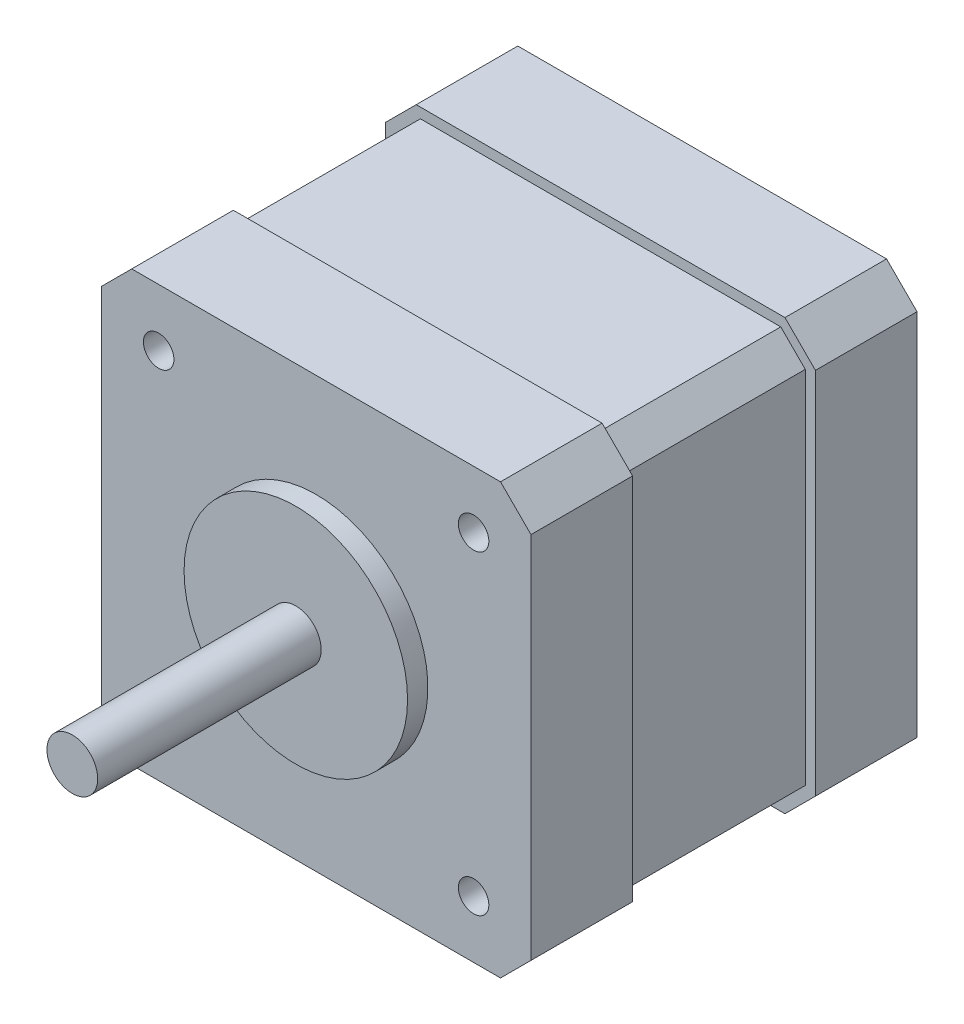
ISO-10303-21;
HEADER;
FILE_DESCRIPTION(('STEP AP214'),'2;1');
FILE_NAME('part.step','',(''),(''),'','','');
FILE_SCHEMA(('AUTOMOTIVE_DESIGN { 1 0 10303 214 1 1 1 1 }'));
ENDSEC;
DATA;
#1=APPLICATION_CONTEXT('core data for automotive mechanical design processes');
#2=APPLICATION_PROTOCOL_DEFINITION('international standard','automotive_design',2000,#1);
#3=PRODUCT_CONTEXT('',#1,'mechanical');
#4=PRODUCT('Part','Part','',(#3));
#5=PRODUCT_RELATED_PRODUCT_CATEGORY('part','',(#4));
#6=PRODUCT_DEFINITION_FORMATION('','',#4);
#7=PRODUCT_DEFINITION_CONTEXT('part definition',#1,'design');
#8=PRODUCT_DEFINITION('design','',#6,#7);
#9=PRODUCT_DEFINITION_SHAPE('','',#8);
#10=(LENGTH_UNIT() NAMED_UNIT(*) SI_UNIT(.MILLI.,.METRE.));
#11=(NAMED_UNIT(*) PLANE_ANGLE_UNIT() SI_UNIT($,.RADIAN.));
#12=(NAMED_UNIT(*) SI_UNIT($,.STERADIAN.) SOLID_ANGLE_UNIT());
#13=UNCERTAINTY_MEASURE_WITH_UNIT(LENGTH_MEASURE(1.E-05),#10,'distance_accuracy_value','');
#14=(GEOMETRIC_REPRESENTATION_CONTEXT(3) GLOBAL_UNCERTAINTY_ASSIGNED_CONTEXT((#13)) GLOBAL_UNIT_ASSIGNED_CONTEXT((#10,
#11,#12)) REPRESENTATION_CONTEXT('',''));
#15=CARTESIAN_POINT('',(0.,0.,0.));
#16=DIRECTION('',(0.,0.,1.));
#17=DIRECTION('',(1.,0.,0.));
#18=AXIS2_PLACEMENT_3D('',#15,#16,#17);
#19=CARTESIAN_POINT('',(0.,0.,0.));
#20=DIRECTION('',(0.,0.,-1.));
#21=DIRECTION('',(-1.,0.,0.));
#22=AXIS2_PLACEMENT_3D('',#19,#20,#21);
#23=PLANE('',#22);
#24=DIRECTION('',(-0.707106781186548,-0.707106781186548,0.));
#25=VECTOR('',#24,1.);
#26=CARTESIAN_POINT('',(-32.7677538051841,19.7638051044083,0.));
#27=LINE('',#26,#25);
#28=CARTESIAN_POINT('',(-29.7677538051841,22.7638051044083,0.));
#29=VERTEX_POINT('',#28);
#30=CARTESIAN_POINT('',(-32.7677538051841,19.7638051044083,0.));
#31=VERTEX_POINT('',#30);
#32=EDGE_CURVE('E147',#29,#31,#27,.T.);
#33=ORIENTED_EDGE('',*,*,#32,.F.);
#34=DIRECTION('',(-1.,0.,0.));
#35=VECTOR('',#34,1.);
#36=CARTESIAN_POINT('',(-29.7677538051841,22.7638051044083,0.));
#37=LINE('',#36,#35);
#38=CARTESIAN_POINT('',(6.53224619481587,22.7638051044083,0.));
#39=VERTEX_POINT('',#38);
#40=EDGE_CURVE('E93',#39,#29,#37,.T.);
#41=ORIENTED_EDGE('',*,*,#40,.F.);
#42=DIRECTION('',(-0.707106781186548,0.707106781186547,0.));
#43=VECTOR('',#42,1.);
#44=CARTESIAN_POINT('',(6.53224619481587,22.7638051044083,0.));
#45=LINE('',#44,#43);
#46=CARTESIAN_POINT('',(9.53224619481587,19.7638051044083,0.));
#47=VERTEX_POINT('',#46);
#48=EDGE_CURVE('E160',#47,#39,#45,.T.);
#49=ORIENTED_EDGE('',*,*,#48,.F.);
#50=DIRECTION('',(0.,1.,0.));
#51=VECTOR('',#50,1.);
#52=CARTESIAN_POINT('',(9.53224619481587,19.7638051044083,0.));
#53=LINE('',#52,#51);
#54=CARTESIAN_POINT('',(9.53224619481587,-16.5361948955916,0.));
#55=VERTEX_POINT('',#54);
#56=EDGE_CURVE('E135',#55,#47,#53,.T.);
#57=ORIENTED_EDGE('',*,*,#56,.F.);
#58=DIRECTION('',(0.707106781186548,0.707106781186547,0.));
#59=VECTOR('',#58,1.);
#60=CARTESIAN_POINT('',(9.53224619481587,-16.5361948955916,0.));
#61=LINE('',#60,#59);
#62=CARTESIAN_POINT('',(6.53224619481587,-19.5361948955916,0.));
#63=VERTEX_POINT('',#62);
#64=EDGE_CURVE('E157',#63,#55,#61,.T.);
#65=ORIENTED_EDGE('',*,*,#64,.F.);
#66=DIRECTION('',(1.,0.,0.));
#67=VECTOR('',#66,1.);
#68=CARTESIAN_POINT('',(6.53224619481587,-19.5361948955916,0.));
#69=LINE('',#68,#67);
#70=CARTESIAN_POINT('',(-29.7677538051841,-19.5361948955916,0.));
#71=VERTEX_POINT('',#70);
#72=EDGE_CURVE('E155',#71,#63,#69,.T.);
#73=ORIENTED_EDGE('',*,*,#72,.F.);
#74=DIRECTION('',(0.707106781186548,-0.707106781186548,0.));
#75=VECTOR('',#74,1.);
#76=CARTESIAN_POINT('',(-29.7677538051841,-19.5361948955916,0.));
#77=LINE('',#76,#75);
#78=CARTESIAN_POINT('',(-32.7677538051841,-16.5361948955916,0.));
#79=VERTEX_POINT('',#78);
#80=EDGE_CURVE('E153',#79,#71,#77,.T.);
#81=ORIENTED_EDGE('',*,*,#80,.F.);
#82=DIRECTION('',(0.,-1.,0.));
#83=VECTOR('',#82,1.);
#84=CARTESIAN_POINT('',(-32.7677538051841,-16.5361948955916,0.));
#85=LINE('',#84,#83);
#86=EDGE_CURVE('E150',#31,#79,#85,.T.);
#87=ORIENTED_EDGE('',*,*,#86,.F.);
#88=EDGE_LOOP('',(#33,#41,#49,#57,#65,#73,#81,#87));
#89=FACE_BOUND('',#88,.T.);
#90=DIRECTION('',(0.707106781186548,-0.707106781186547,0.));
#91=VECTOR('',#90,1.);
#92=CARTESIAN_POINT('',(8.53224619481587,19.3495915420353,0.));
#93=LINE('',#92,#91);
#94=CARTESIAN_POINT('',(6.11803263244278,21.7638051044083,0.));
#95=VERTEX_POINT('',#94);
#96=CARTESIAN_POINT('',(8.53224619481587,19.3495915420353,0.));
#97=VERTEX_POINT('',#96);
#98=EDGE_CURVE('E303',#95,#97,#93,.T.);
#99=ORIENTED_EDGE('',*,*,#98,.F.);
#100=DIRECTION('',(1.,0.,0.));
#101=VECTOR('',#100,1.);
#102=CARTESIAN_POINT('',(-11.6177538051841,21.7638051044083,0.));
#103=LINE('',#102,#101);
#104=CARTESIAN_POINT('',(-29.353540242811,21.7638051044083,0.));
#105=VERTEX_POINT('',#104);
#106=EDGE_CURVE('E254',#105,#95,#103,.T.);
#107=ORIENTED_EDGE('',*,*,#106,.F.);
#108=DIRECTION('',(0.707106781186547,0.707106781186547,0.));
#109=VECTOR('',#108,1.);
#110=CARTESIAN_POINT('',(-29.353540242811,21.7638051044083,0.));
#111=LINE('',#110,#109);
#112=CARTESIAN_POINT('',(-31.7677538051841,19.3495915420352,0.));
#113=VERTEX_POINT('',#112);
#114=EDGE_CURVE('E279',#113,#105,#111,.T.);
#115=ORIENTED_EDGE('',*,*,#114,.F.);
#116=DIRECTION('',(0.,1.,0.));
#117=VECTOR('',#116,1.);
#118=CARTESIAN_POINT('',(-31.7677538051841,-16.1219813332185,0.));
#119=LINE('',#118,#117);
#120=CARTESIAN_POINT('',(-31.7677538051841,-16.1219813332185,0.));
#121=VERTEX_POINT('',#120);
#122=EDGE_CURVE('E318',#121,#113,#119,.T.);
#123=ORIENTED_EDGE('',*,*,#122,.F.);
#124=DIRECTION('',(-0.707106781186549,0.707106781186547,0.));
#125=VECTOR('',#124,1.);
#126=CARTESIAN_POINT('',(-29.353540242811,-18.5361948955917,0.));
#127=LINE('',#126,#125);
#128=CARTESIAN_POINT('',(-29.353540242811,-18.5361948955917,0.));
#129=VERTEX_POINT('',#128);
#130=EDGE_CURVE('E315',#129,#121,#127,.T.);
#131=ORIENTED_EDGE('',*,*,#130,.F.);
#132=DIRECTION('',(-1.,0.,0.));
#133=VECTOR('',#132,1.);
#134=CARTESIAN_POINT('',(6.11803263244278,-18.5361948955916,0.));
#135=LINE('',#134,#133);
#136=CARTESIAN_POINT('',(6.11803263244278,-18.5361948955916,0.));
#137=VERTEX_POINT('',#136);
#138=EDGE_CURVE('E312',#137,#129,#135,.T.);
#139=ORIENTED_EDGE('',*,*,#138,.F.);
#140=DIRECTION('',(-0.707106781186547,-0.707106781186547,0.));
#141=VECTOR('',#140,1.);
#142=CARTESIAN_POINT('',(8.53224619481587,-16.1219813332186,0.));
#143=LINE('',#142,#141);
#144=CARTESIAN_POINT('',(8.53224619481587,-16.1219813332186,0.));
#145=VERTEX_POINT('',#144);
#146=EDGE_CURVE('E309',#145,#137,#143,.T.);
#147=ORIENTED_EDGE('',*,*,#146,.F.);
#148=DIRECTION('',(0.,-1.,0.));
#149=VECTOR('',#148,1.);
#150=CARTESIAN_POINT('',(8.53224619481587,19.3495915420353,0.));
#151=LINE('',#150,#149);
#152=EDGE_CURVE('E306',#97,#145,#151,.T.);
#153=ORIENTED_EDGE('',*,*,#152,.F.);
#154=EDGE_LOOP('',(#99,#107,#115,#123,#131,#139,#147,#153));
#155=FACE_BOUND('',#154,.T.);
#156=ADVANCED_FACE('F34',(#89,#155),#23,.T.);
#157=CARTESIAN_POINT('',(-11.6177538051841,1.61380510440835,12.));
#158=DIRECTION('',(0.,0.,1.));
#159=DIRECTION('',(1.,0.,0.));
#160=AXIS2_PLACEMENT_3D('',#157,#158,#159);
#161=PLANE('',#160);
#162=CARTESIAN_POINT('',(-11.6177538051841,1.61380510440835,12.));
#163=DIRECTION('',(0.,0.,1.));
#164=DIRECTION('',(1.,0.,0.));
#165=AXIS2_PLACEMENT_3D('',#162,#163,#164);
#166=CIRCLE('',#165,11.);
#167=CARTESIAN_POINT('',(-0.617753805184125,1.61380510440835,12.));
#168=VERTEX_POINT('',#167);
#169=EDGE_CURVE('E151',#168,#168,#166,.T.);
#170=ORIENTED_EDGE('',*,*,#169,.T.);
#171=EDGE_LOOP('',(#170));
#172=FACE_BOUND('',#171,.T.);
#173=CARTESIAN_POINT('',(-11.6177538051841,1.61380510440835,12.));
#174=DIRECTION('',(0.,0.,1.));
#175=DIRECTION('',(1.,0.,0.));
#176=AXIS2_PLACEMENT_3D('',#173,#174,#175);
#177=CIRCLE('',#176,2.5);
#178=CARTESIAN_POINT('',(-9.11775380518413,1.61380510440835,12.));
#179=VERTEX_POINT('',#178);
#180=EDGE_CURVE('E342',#179,#179,#177,.T.);
#181=ORIENTED_EDGE('',*,*,#180,.F.);
#182=EDGE_LOOP('',(#181));
#183=FACE_BOUND('',#182,.T.);
#184=ADVANCED_FACE('F384',(#172,#183),#161,.T.);
#185=CARTESIAN_POINT('',(0.,0.,10.));
#186=DIRECTION('',(0.,0.,-1.));
#187=DIRECTION('',(-1.,0.,0.));
#188=AXIS2_PLACEMENT_3D('',#185,#186,#187);
#189=PLANE('',#188);
#190=CARTESIAN_POINT('',(-27.1177538051841,-13.8861948955917,10.));
#191=DIRECTION('',(0.,0.,1.));
#192=DIRECTION('',(1.,0.,0.));
#193=AXIS2_PLACEMENT_3D('',#190,#191,#192);
#194=CIRCLE('',#193,1.5);
#195=CARTESIAN_POINT('',(-25.6177538051841,-13.8861948955917,10.));
#196=VERTEX_POINT('',#195);
#197=EDGE_CURVE('E197',#196,#196,#194,.T.);
#198=ORIENTED_EDGE('',*,*,#197,.F.);
#199=EDGE_LOOP('',(#198));
#200=FACE_BOUND('',#199,.T.);
#201=CARTESIAN_POINT('',(3.88224619481587,-13.8861948955917,10.));
#202=DIRECTION('',(0.,0.,1.));
#203=DIRECTION('',(1.,0.,0.));
#204=AXIS2_PLACEMENT_3D('',#201,#202,#203);
#205=CIRCLE('',#204,1.5);
#206=CARTESIAN_POINT('',(5.38224619481587,-13.8861948955917,10.));
#207=VERTEX_POINT('',#206);
#208=EDGE_CURVE('E187',#207,#207,#205,.T.);
#209=ORIENTED_EDGE('',*,*,#208,.F.);
#210=EDGE_LOOP('',(#209));
#211=FACE_BOUND('',#210,.T.);
#212=CARTESIAN_POINT('',(3.88224619481587,17.1138051044083,10.));
#213=DIRECTION('',(0.,0.,1.));
#214=DIRECTION('',(1.,0.,0.));
#215=AXIS2_PLACEMENT_3D('',#212,#213,#214);
#216=CIRCLE('',#215,1.5);
#217=CARTESIAN_POINT('',(5.38224619481587,17.1138051044083,10.));
#218=VERTEX_POINT('',#217);
#219=EDGE_CURVE('E184',#218,#218,#216,.T.);
#220=ORIENTED_EDGE('',*,*,#219,.F.);
#221=EDGE_LOOP('',(#220));
#222=FACE_BOUND('',#221,.T.);
#223=CARTESIAN_POINT('',(-27.1177538051841,17.1138051044083,10.));
#224=DIRECTION('',(0.,0.,1.));
#225=DIRECTION('',(1.,0.,0.));
#226=AXIS2_PLACEMENT_3D('',#223,#224,#225);
#227=CIRCLE('',#226,1.5);
#228=CARTESIAN_POINT('',(-25.6177538051841,17.1138051044083,10.));
#229=VERTEX_POINT('',#228);
#230=EDGE_CURVE('E181',#229,#229,#227,.T.);
#231=ORIENTED_EDGE('',*,*,#230,.F.);
#232=EDGE_LOOP('',(#231));
#233=FACE_BOUND('',#232,.T.);
#234=DIRECTION('',(-0.707106781186548,-0.707106781186548,0.));
#235=VECTOR('',#234,1.);
#236=CARTESIAN_POINT('',(-32.7677538051841,19.7638051044083,10.));
#237=LINE('',#236,#235);
#238=CARTESIAN_POINT('',(-29.7677538051841,22.7638051044083,10.));
#239=VERTEX_POINT('',#238);
#240=CARTESIAN_POINT('',(-32.7677538051841,19.7638051044083,10.));
#241=VERTEX_POINT('',#240);
#242=EDGE_CURVE('E163',#239,#241,#237,.T.);
#243=ORIENTED_EDGE('',*,*,#242,.T.);
#244=DIRECTION('',(0.,-1.,0.));
#245=VECTOR('',#244,1.);
#246=CARTESIAN_POINT('',(-32.7677538051841,-16.5361948955916,10.));
#247=LINE('',#246,#245);
#248=CARTESIAN_POINT('',(-32.7677538051841,-16.5361948955916,10.));
#249=VERTEX_POINT('',#248);
#250=EDGE_CURVE('E102',#241,#249,#247,.T.);
#251=ORIENTED_EDGE('',*,*,#250,.T.);
#252=DIRECTION('',(0.707106781186548,-0.707106781186548,0.));
#253=VECTOR('',#252,1.);
#254=CARTESIAN_POINT('',(-29.7677538051841,-19.5361948955916,10.));
#255=LINE('',#254,#253);
#256=CARTESIAN_POINT('',(-29.7677538051841,-19.5361948955916,10.));
#257=VERTEX_POINT('',#256);
#258=EDGE_CURVE('E352',#249,#257,#255,.T.);
#259=ORIENTED_EDGE('',*,*,#258,.T.);
#260=DIRECTION('',(1.,0.,0.));
#261=VECTOR('',#260,1.);
#262=CARTESIAN_POINT('',(6.53224619481587,-19.5361948955916,10.));
#263=LINE('',#262,#261);
#264=CARTESIAN_POINT('',(6.53224619481587,-19.5361948955916,10.));
#265=VERTEX_POINT('',#264);
#266=EDGE_CURVE('E354',#257,#265,#263,.T.);
#267=ORIENTED_EDGE('',*,*,#266,.T.);
#268=DIRECTION('',(0.707106781186548,0.707106781186547,0.));
#269=VECTOR('',#268,1.);
#270=CARTESIAN_POINT('',(9.53224619481587,-16.5361948955916,10.));
#271=LINE('',#270,#269);
#272=CARTESIAN_POINT('',(9.53224619481587,-16.5361948955916,10.));
#273=VERTEX_POINT('',#272);
#274=EDGE_CURVE('E126',#265,#273,#271,.T.);
#275=ORIENTED_EDGE('',*,*,#274,.T.);
#276=DIRECTION('',(0.,1.,0.));
#277=VECTOR('',#276,1.);
#278=CARTESIAN_POINT('',(9.53224619481587,19.7638051044083,10.));
#279=LINE('',#278,#277);
#280=CARTESIAN_POINT('',(9.53224619481587,19.7638051044083,10.));
#281=VERTEX_POINT('',#280);
#282=EDGE_CURVE('E118',#273,#281,#279,.T.);
#283=ORIENTED_EDGE('',*,*,#282,.T.);
#284=DIRECTION('',(-0.707106781186548,0.707106781186547,0.));
#285=VECTOR('',#284,1.);
#286=CARTESIAN_POINT('',(6.53224619481587,22.7638051044083,10.));
#287=LINE('',#286,#285);
#288=CARTESIAN_POINT('',(6.53224619481587,22.7638051044083,10.));
#289=VERTEX_POINT('',#288);
#290=EDGE_CURVE('E123',#281,#289,#287,.T.);
#291=ORIENTED_EDGE('',*,*,#290,.T.);
#292=DIRECTION('',(-1.,0.,0.));
#293=VECTOR('',#292,1.);
#294=CARTESIAN_POINT('',(-29.7677538051841,22.7638051044083,10.));
#295=LINE('',#294,#293);
#296=EDGE_CURVE('E60',#289,#239,#295,.T.);
#297=ORIENTED_EDGE('',*,*,#296,.T.);
#298=EDGE_LOOP('',(#243,#251,#259,#267,#275,#283,#291,#297));
#299=FACE_BOUND('',#298,.T.);
#300=CARTESIAN_POINT('',(-11.6177538051841,1.61380510440835,10.));
#301=DIRECTION('',(0.,0.,-1.));
#302=DIRECTION('',(-1.,0.,0.));
#303=AXIS2_PLACEMENT_3D('',#300,#301,#302);
#304=CIRCLE('',#303,11.);
#305=CARTESIAN_POINT('',(-22.6177538051841,1.61380510440835,10.));
#306=VERTEX_POINT('',#305);
#307=EDGE_CURVE('E11',#306,#306,#304,.F.);
#308=ORIENTED_EDGE('',*,*,#307,.F.);
#309=EDGE_LOOP('',(#308));
#310=FACE_BOUND('',#309,.T.);
#311=ADVANCED_FACE('F120',(#200,#211,#222,#233,#299,#310),#189,.F.);
#312=CARTESIAN_POINT('',(-32.7677538051841,19.7638051044083,10.));
#313=DIRECTION('',(0.707106781186548,-0.707106781186548,0.));
#314=DIRECTION('',(0.707106781186548,0.707106781186548,0.));
#315=AXIS2_PLACEMENT_3D('',#312,#313,#314);
#316=PLANE('',#315);
#317=ORIENTED_EDGE('',*,*,#32,.T.);
#318=DIRECTION('',(0.,0.,-1.));
#319=VECTOR('',#318,1.);
#320=CARTESIAN_POINT('',(-32.7677538051841,19.7638051044083,10.));
#321=LINE('',#320,#319);
#322=EDGE_CURVE('E43',#241,#31,#321,.T.);
#323=ORIENTED_EDGE('',*,*,#322,.F.);
#324=ORIENTED_EDGE('',*,*,#242,.F.);
#325=DIRECTION('',(0.,0.,-1.));
#326=VECTOR('',#325,1.);
#327=CARTESIAN_POINT('',(-29.7677538051841,22.7638051044083,10.));
#328=LINE('',#327,#326);
#329=EDGE_CURVE('E143',#239,#29,#328,.T.);
#330=ORIENTED_EDGE('',*,*,#329,.T.);
#331=EDGE_LOOP('',(#317,#323,#324,#330));
#332=FACE_BOUND('',#331,.T.);
#333=ADVANCED_FACE('F36',(#332),#316,.F.);
#334=CARTESIAN_POINT('',(-32.7677538051841,-16.5361948955916,10.));
#335=DIRECTION('',(1.,0.,0.));
#336=DIRECTION('',(0.,0.,-1.));
#337=AXIS2_PLACEMENT_3D('',#334,#335,#336);
#338=PLANE('',#337);
#339=ORIENTED_EDGE('',*,*,#86,.T.);
#340=DIRECTION('',(0.,0.,-1.));
#341=VECTOR('',#340,1.);
#342=CARTESIAN_POINT('',(-32.7677538051841,-16.5361948955916,10.));
#343=LINE('',#342,#341);
#344=EDGE_CURVE('E173',#249,#79,#343,.T.);
#345=ORIENTED_EDGE('',*,*,#344,.F.);
#346=ORIENTED_EDGE('',*,*,#250,.F.);
#347=ORIENTED_EDGE('',*,*,#322,.T.);
#348=EDGE_LOOP('',(#339,#345,#346,#347));
#349=FACE_BOUND('',#348,.T.);
#350=ADVANCED_FACE('F372',(#349),#338,.F.);
#351=CARTESIAN_POINT('',(-29.7677538051841,-19.5361948955916,10.));
#352=DIRECTION('',(0.707106781186548,0.707106781186548,0.));
#353=DIRECTION('',(-0.707106781186548,0.707106781186548,0.));
#354=AXIS2_PLACEMENT_3D('',#351,#352,#353);
#355=PLANE('',#354);
#356=ORIENTED_EDGE('',*,*,#80,.T.);
#357=DIRECTION('',(0.,0.,-1.));
#358=VECTOR('',#357,1.);
#359=CARTESIAN_POINT('',(-29.7677538051841,-19.5361948955916,10.));
#360=LINE('',#359,#358);
#361=EDGE_CURVE('E170',#257,#71,#360,.T.);
#362=ORIENTED_EDGE('',*,*,#361,.F.);
#363=ORIENTED_EDGE('',*,*,#258,.F.);
#364=ORIENTED_EDGE('',*,*,#344,.T.);
#365=EDGE_LOOP('',(#356,#362,#363,#364));
#366=FACE_BOUND('',#365,.T.);
#367=ADVANCED_FACE('F375',(#366),#355,.F.);
#368=CARTESIAN_POINT('',(6.53224619481587,-19.5361948955916,10.));
#369=DIRECTION('',(0.,1.,0.));
#370=DIRECTION('',(0.,0.,1.));
#371=AXIS2_PLACEMENT_3D('',#368,#369,#370);
#372=PLANE('',#371);
#373=ORIENTED_EDGE('',*,*,#72,.T.);
#374=DIRECTION('',(0.,0.,-1.));
#375=VECTOR('',#374,1.);
#376=CARTESIAN_POINT('',(6.53224619481587,-19.5361948955916,10.));
#377=LINE('',#376,#375);
#378=EDGE_CURVE('E167',#265,#63,#377,.T.);
#379=ORIENTED_EDGE('',*,*,#378,.F.);
#380=ORIENTED_EDGE('',*,*,#266,.F.);
#381=ORIENTED_EDGE('',*,*,#361,.T.);
#382=EDGE_LOOP('',(#373,#379,#380,#381));
#383=FACE_BOUND('',#382,.T.);
#384=ADVANCED_FACE('F360',(#383),#372,.F.);
#385=CARTESIAN_POINT('',(9.53224619481587,-16.5361948955916,10.));
#386=DIRECTION('',(-0.707106781186547,0.707106781186548,0.));
#387=DIRECTION('',(-0.707106781186548,-0.707106781186547,0.));
#388=AXIS2_PLACEMENT_3D('',#385,#386,#387);
#389=PLANE('',#388);
#390=ORIENTED_EDGE('',*,*,#64,.T.);
#391=DIRECTION('',(0.,0.,-1.));
#392=VECTOR('',#391,1.);
#393=CARTESIAN_POINT('',(9.53224619481587,-16.5361948955916,10.));
#394=LINE('',#393,#392);
#395=EDGE_CURVE('E138',#273,#55,#394,.T.);
#396=ORIENTED_EDGE('',*,*,#395,.F.);
#397=ORIENTED_EDGE('',*,*,#274,.F.);
#398=ORIENTED_EDGE('',*,*,#378,.T.);
#399=EDGE_LOOP('',(#390,#396,#397,#398));
#400=FACE_BOUND('',#399,.T.);
#401=ADVANCED_FACE('F364',(#400),#389,.F.);
#402=CARTESIAN_POINT('',(9.53224619481587,19.7638051044083,10.));
#403=DIRECTION('',(-1.,0.,0.));
#404=DIRECTION('',(0.,0.,1.));
#405=AXIS2_PLACEMENT_3D('',#402,#403,#404);
#406=PLANE('',#405);
#407=ORIENTED_EDGE('',*,*,#56,.T.);
#408=DIRECTION('',(0.,0.,-1.));
#409=VECTOR('',#408,1.);
#410=CARTESIAN_POINT('',(9.53224619481587,19.7638051044083,10.));
#411=LINE('',#410,#409);
#412=EDGE_CURVE('E132',#281,#47,#411,.T.);
#413=ORIENTED_EDGE('',*,*,#412,.F.);
#414=ORIENTED_EDGE('',*,*,#282,.F.);
#415=ORIENTED_EDGE('',*,*,#395,.T.);
#416=EDGE_LOOP('',(#407,#413,#414,#415));
#417=FACE_BOUND('',#416,.T.);
#418=ADVANCED_FACE('F133',(#417),#406,.F.);
#419=CARTESIAN_POINT('',(6.53224619481587,22.7638051044083,10.));
#420=DIRECTION('',(-0.707106781186547,-0.707106781186548,0.));
#421=DIRECTION('',(0.707106781186548,-0.707106781186547,0.));
#422=AXIS2_PLACEMENT_3D('',#419,#420,#421);
#423=PLANE('',#422);
#424=ORIENTED_EDGE('',*,*,#48,.T.);
#425=DIRECTION('',(0.,0.,-1.));
#426=VECTOR('',#425,1.);
#427=CARTESIAN_POINT('',(6.53224619481587,22.7638051044083,10.));
#428=LINE('',#427,#426);
#429=EDGE_CURVE('E139',#289,#39,#428,.T.);
#430=ORIENTED_EDGE('',*,*,#429,.F.);
#431=ORIENTED_EDGE('',*,*,#290,.F.);
#432=ORIENTED_EDGE('',*,*,#412,.T.);
#433=EDGE_LOOP('',(#424,#430,#431,#432));
#434=FACE_BOUND('',#433,.T.);
#435=ADVANCED_FACE('F141',(#434),#423,.F.);
#436=CARTESIAN_POINT('',(-29.7677538051841,22.7638051044083,10.));
#437=DIRECTION('',(0.,-1.,0.));
#438=DIRECTION('',(0.,0.,-1.));
#439=AXIS2_PLACEMENT_3D('',#436,#437,#438);
#440=PLANE('',#439);
#441=ORIENTED_EDGE('',*,*,#40,.T.);
#442=ORIENTED_EDGE('',*,*,#329,.F.);
#443=ORIENTED_EDGE('',*,*,#296,.F.);
#444=ORIENTED_EDGE('',*,*,#429,.T.);
#445=EDGE_LOOP('',(#441,#442,#443,#444));
#446=FACE_BOUND('',#445,.T.);
#447=ADVANCED_FACE('F368',(#446),#440,.F.);
#448=CARTESIAN_POINT('',(-11.6177538051841,1.61380510440835,12.));
#449=DIRECTION('',(0.,0.,-1.));
#450=DIRECTION('',(-1.,0.,0.));
#451=AXIS2_PLACEMENT_3D('',#448,#449,#450);
#452=CYLINDRICAL_SURFACE('',#451,11.);
#453=ORIENTED_EDGE('',*,*,#169,.F.);
#454=EDGE_LOOP('',(#453));
#455=FACE_BOUND('',#454,.T.);
#456=ORIENTED_EDGE('',*,*,#307,.T.);
#457=EDGE_LOOP('',(#456));
#458=FACE_BOUND('',#457,.T.);
#459=ADVANCED_FACE('F396',(#455,#458),#452,.T.);
#460=CARTESIAN_POINT('',(-11.6177538051841,1.61380510440835,34.));
#461=DIRECTION('',(0.,0.,-1.));
#462=DIRECTION('',(-1.,0.,0.));
#463=AXIS2_PLACEMENT_3D('',#460,#461,#462);
#464=CYLINDRICAL_SURFACE('',#463,2.5);
#465=CARTESIAN_POINT('',(-11.6177538051841,1.61380510440835,34.));
#466=DIRECTION('',(0.,0.,1.));
#467=DIRECTION('',(1.,0.,0.));
#468=AXIS2_PLACEMENT_3D('',#465,#466,#467);
#469=CIRCLE('',#468,2.5);
#470=CARTESIAN_POINT('',(-9.11775380518413,1.61380510440835,34.));
#471=VERTEX_POINT('',#470);
#472=EDGE_CURVE('E343',#471,#471,#469,.T.);
#473=ORIENTED_EDGE('',*,*,#472,.F.);
#474=EDGE_LOOP('',(#473));
#475=FACE_BOUND('',#474,.T.);
#476=ORIENTED_EDGE('',*,*,#180,.T.);
#477=EDGE_LOOP('',(#476));
#478=FACE_BOUND('',#477,.T.);
#479=ADVANCED_FACE('F425',(#475,#478),#464,.T.);
#480=CARTESIAN_POINT('',(-11.6177538051841,1.61380510440835,34.));
#481=DIRECTION('',(0.,0.,1.));
#482=DIRECTION('',(1.,0.,0.));
#483=AXIS2_PLACEMENT_3D('',#480,#481,#482);
#484=PLANE('',#483);
#485=ORIENTED_EDGE('',*,*,#472,.T.);
#486=EDGE_LOOP('',(#485));
#487=FACE_BOUND('',#486,.T.);
#488=ADVANCED_FACE('F433',(#487),#484,.T.);
#489=CARTESIAN_POINT('',(-11.6177538051841,21.7638051044083,-18.));
#490=DIRECTION('',(0.,-1.,0.));
#491=DIRECTION('',(0.,0.,-1.));
#492=AXIS2_PLACEMENT_3D('',#489,#490,#491);
#493=PLANE('',#492);
#494=ORIENTED_EDGE('',*,*,#106,.T.);
#495=DIRECTION('',(0.,0.,1.));
#496=VECTOR('',#495,1.);
#497=CARTESIAN_POINT('',(6.11803263244278,21.7638051044083,-18.));
#498=LINE('',#497,#496);
#499=CARTESIAN_POINT('',(6.11803263244278,21.7638051044083,-18.));
#500=VERTEX_POINT('',#499);
#501=EDGE_CURVE('E339',#500,#95,#498,.T.);
#502=ORIENTED_EDGE('',*,*,#501,.F.);
#503=DIRECTION('',(1.,0.,0.));
#504=VECTOR('',#503,1.);
#505=CARTESIAN_POINT('',(-11.6177538051841,21.7638051044083,-18.));
#506=LINE('',#505,#504);
#507=CARTESIAN_POINT('',(-29.353540242811,21.7638051044083,-18.));
#508=VERTEX_POINT('',#507);
#509=EDGE_CURVE('E275',#508,#500,#506,.T.);
#510=ORIENTED_EDGE('',*,*,#509,.F.);
#511=DIRECTION('',(0.,0.,1.));
#512=VECTOR('',#511,1.);
#513=CARTESIAN_POINT('',(-29.353540242811,21.7638051044083,-18.));
#514=LINE('',#513,#512);
#515=EDGE_CURVE('E300',#508,#105,#514,.T.);
#516=ORIENTED_EDGE('',*,*,#515,.T.);
#517=EDGE_LOOP('',(#494,#502,#510,#516));
#518=FACE_BOUND('',#517,.T.);
#519=ADVANCED_FACE('F441',(#518),#493,.F.);
#520=CARTESIAN_POINT('',(8.53224619481587,19.3495915420353,-18.));
#521=DIRECTION('',(-0.707106781186547,-0.707106781186548,0.));
#522=DIRECTION('',(0.707106781186548,-0.707106781186547,0.));
#523=AXIS2_PLACEMENT_3D('',#520,#521,#522);
#524=PLANE('',#523);
#525=ORIENTED_EDGE('',*,*,#98,.T.);
#526=DIRECTION('',(0.,0.,1.));
#527=VECTOR('',#526,1.);
#528=CARTESIAN_POINT('',(8.53224619481587,19.3495915420353,-18.));
#529=LINE('',#528,#527);
#530=CARTESIAN_POINT('',(8.53224619481587,19.3495915420353,-18.));
#531=VERTEX_POINT('',#530);
#532=EDGE_CURVE('E336',#531,#97,#529,.T.);
#533=ORIENTED_EDGE('',*,*,#532,.F.);
#534=DIRECTION('',(0.707106781186548,-0.707106781186547,0.));
#535=VECTOR('',#534,1.);
#536=CARTESIAN_POINT('',(8.53224619481587,19.3495915420353,-18.));
#537=LINE('',#536,#535);
#538=EDGE_CURVE('E278',#500,#531,#537,.T.);
#539=ORIENTED_EDGE('',*,*,#538,.F.);
#540=ORIENTED_EDGE('',*,*,#501,.T.);
#541=EDGE_LOOP('',(#525,#533,#539,#540));
#542=FACE_BOUND('',#541,.T.);
#543=ADVANCED_FACE('F449',(#542),#524,.F.);
#544=CARTESIAN_POINT('',(8.53224619481587,19.3495915420353,-18.));
#545=DIRECTION('',(-1.,0.,0.));
#546=DIRECTION('',(0.,0.,1.));
#547=AXIS2_PLACEMENT_3D('',#544,#545,#546);
#548=PLANE('',#547);
#549=ORIENTED_EDGE('',*,*,#152,.T.);
#550=DIRECTION('',(0.,0.,1.));
#551=VECTOR('',#550,1.);
#552=CARTESIAN_POINT('',(8.53224619481587,-16.1219813332186,-18.));
#553=LINE('',#552,#551);
#554=CARTESIAN_POINT('',(8.53224619481587,-16.1219813332186,-18.));
#555=VERTEX_POINT('',#554);
#556=EDGE_CURVE('E333',#555,#145,#553,.T.);
#557=ORIENTED_EDGE('',*,*,#556,.F.);
#558=DIRECTION('',(0.,-1.,0.));
#559=VECTOR('',#558,1.);
#560=CARTESIAN_POINT('',(8.53224619481587,19.3495915420353,-18.));
#561=LINE('',#560,#559);
#562=EDGE_CURVE('E282',#531,#555,#561,.T.);
#563=ORIENTED_EDGE('',*,*,#562,.F.);
#564=ORIENTED_EDGE('',*,*,#532,.T.);
#565=EDGE_LOOP('',(#549,#557,#563,#564));
#566=FACE_BOUND('',#565,.T.);
#567=ADVANCED_FACE('F457',(#566),#548,.F.);
#568=CARTESIAN_POINT('',(8.53224619481587,-16.1219813332186,-18.));
#569=DIRECTION('',(-0.707106781186547,0.707106781186547,0.));
#570=DIRECTION('',(-0.707106781186548,-0.707106781186548,0.));
#571=AXIS2_PLACEMENT_3D('',#568,#569,#570);
#572=PLANE('',#571);
#573=ORIENTED_EDGE('',*,*,#146,.T.);
#574=DIRECTION('',(0.,0.,1.));
#575=VECTOR('',#574,1.);
#576=CARTESIAN_POINT('',(6.11803263244278,-18.5361948955916,-18.));
#577=LINE('',#576,#575);
#578=CARTESIAN_POINT('',(6.11803263244278,-18.5361948955916,-18.));
#579=VERTEX_POINT('',#578);
#580=EDGE_CURVE('E330',#579,#137,#577,.T.);
#581=ORIENTED_EDGE('',*,*,#580,.F.);
#582=DIRECTION('',(-0.707106781186547,-0.707106781186547,0.));
#583=VECTOR('',#582,1.);
#584=CARTESIAN_POINT('',(8.53224619481587,-16.1219813332186,-18.));
#585=LINE('',#584,#583);
#586=EDGE_CURVE('E285',#555,#579,#585,.T.);
#587=ORIENTED_EDGE('',*,*,#586,.F.);
#588=ORIENTED_EDGE('',*,*,#556,.T.);
#589=EDGE_LOOP('',(#573,#581,#587,#588));
#590=FACE_BOUND('',#589,.T.);
#591=ADVANCED_FACE('F465',(#590),#572,.F.);
#592=CARTESIAN_POINT('',(6.11803263244278,-18.5361948955916,-18.));
#593=DIRECTION('',(0.,1.,0.));
#594=DIRECTION('',(-1.,0.,0.));
#595=AXIS2_PLACEMENT_3D('',#592,#593,#594);
#596=PLANE('',#595);
#597=ORIENTED_EDGE('',*,*,#138,.T.);
#598=DIRECTION('',(0.,0.,1.));
#599=VECTOR('',#598,1.);
#600=CARTESIAN_POINT('',(-29.353540242811,-18.5361948955917,-18.));
#601=LINE('',#600,#599);
#602=CARTESIAN_POINT('',(-29.353540242811,-18.5361948955917,-18.));
#603=VERTEX_POINT('',#602);
#604=EDGE_CURVE('E327',#603,#129,#601,.T.);
#605=ORIENTED_EDGE('',*,*,#604,.F.);
#606=DIRECTION('',(-1.,0.,0.));
#607=VECTOR('',#606,1.);
#608=CARTESIAN_POINT('',(6.11803263244278,-18.5361948955916,-18.));
#609=LINE('',#608,#607);
#610=EDGE_CURVE('E288',#579,#603,#609,.T.);
#611=ORIENTED_EDGE('',*,*,#610,.F.);
#612=ORIENTED_EDGE('',*,*,#580,.T.);
#613=EDGE_LOOP('',(#597,#605,#611,#612));
#614=FACE_BOUND('',#613,.T.);
#615=ADVANCED_FACE('F473',(#614),#596,.F.);
#616=CARTESIAN_POINT('',(-29.353540242811,-18.5361948955917,-18.));
#617=DIRECTION('',(0.707106781186547,0.707106781186548,0.));
#618=DIRECTION('',(-0.707106781186548,0.707106781186547,0.));
#619=AXIS2_PLACEMENT_3D('',#616,#617,#618);
#620=PLANE('',#619);
#621=ORIENTED_EDGE('',*,*,#130,.T.);
#622=DIRECTION('',(0.,0.,1.));
#623=VECTOR('',#622,1.);
#624=CARTESIAN_POINT('',(-31.7677538051841,-16.1219813332185,-18.));
#625=LINE('',#624,#623);
#626=CARTESIAN_POINT('',(-31.7677538051841,-16.1219813332185,-18.));
#627=VERTEX_POINT('',#626);
#628=EDGE_CURVE('E324',#627,#121,#625,.T.);
#629=ORIENTED_EDGE('',*,*,#628,.F.);
#630=DIRECTION('',(-0.707106781186549,0.707106781186547,0.));
#631=VECTOR('',#630,1.);
#632=CARTESIAN_POINT('',(-29.353540242811,-18.5361948955917,-18.));
#633=LINE('',#632,#631);
#634=EDGE_CURVE('E291',#603,#627,#633,.T.);
#635=ORIENTED_EDGE('',*,*,#634,.F.);
#636=ORIENTED_EDGE('',*,*,#604,.T.);
#637=EDGE_LOOP('',(#621,#629,#635,#636));
#638=FACE_BOUND('',#637,.T.);
#639=ADVANCED_FACE('F481',(#638),#620,.F.);
#640=CARTESIAN_POINT('',(-31.7677538051841,-16.1219813332185,-18.));
#641=DIRECTION('',(1.,0.,0.));
#642=DIRECTION('',(0.,0.,-1.));
#643=AXIS2_PLACEMENT_3D('',#640,#641,#642);
#644=PLANE('',#643);
#645=ORIENTED_EDGE('',*,*,#122,.T.);
#646=DIRECTION('',(0.,0.,1.));
#647=VECTOR('',#646,1.);
#648=CARTESIAN_POINT('',(-31.7677538051841,19.3495915420352,-18.));
#649=LINE('',#648,#647);
#650=CARTESIAN_POINT('',(-31.7677538051841,19.3495915420352,-18.));
#651=VERTEX_POINT('',#650);
#652=EDGE_CURVE('E51',#651,#113,#649,.T.);
#653=ORIENTED_EDGE('',*,*,#652,.F.);
#654=DIRECTION('',(0.,1.,0.));
#655=VECTOR('',#654,1.);
#656=CARTESIAN_POINT('',(-31.7677538051841,-16.1219813332185,-18.));
#657=LINE('',#656,#655);
#658=EDGE_CURVE('E294',#627,#651,#657,.T.);
#659=ORIENTED_EDGE('',*,*,#658,.F.);
#660=ORIENTED_EDGE('',*,*,#628,.T.);
#661=EDGE_LOOP('',(#645,#653,#659,#660));
#662=FACE_BOUND('',#661,.T.);
#663=ADVANCED_FACE('F489',(#662),#644,.F.);
#664=CARTESIAN_POINT('',(-29.353540242811,21.7638051044083,-18.));
#665=DIRECTION('',(0.707106781186547,-0.707106781186547,0.));
#666=DIRECTION('',(0.707106781186548,0.707106781186548,0.));
#667=AXIS2_PLACEMENT_3D('',#664,#665,#666);
#668=PLANE('',#667);
#669=ORIENTED_EDGE('',*,*,#114,.T.);
#670=ORIENTED_EDGE('',*,*,#515,.F.);
#671=DIRECTION('',(0.707106781186547,0.707106781186547,0.));
#672=VECTOR('',#671,1.);
#673=CARTESIAN_POINT('',(-29.353540242811,21.7638051044083,-18.));
#674=LINE('',#673,#672);
#675=EDGE_CURVE('E297',#651,#508,#674,.T.);
#676=ORIENTED_EDGE('',*,*,#675,.F.);
#677=ORIENTED_EDGE('',*,*,#652,.T.);
#678=EDGE_LOOP('',(#669,#670,#676,#677));
#679=FACE_BOUND('',#678,.T.);
#680=ADVANCED_FACE('F497',(#679),#668,.F.);
#681=CARTESIAN_POINT('',(0.,0.,-18.));
#682=DIRECTION('',(0.,0.,-1.));
#683=DIRECTION('',(-1.,0.,0.));
#684=AXIS2_PLACEMENT_3D('',#681,#682,#683);
#685=PLANE('',#684);
#686=DIRECTION('',(-0.707106781186548,-0.707106781186548,0.));
#687=VECTOR('',#686,1.);
#688=CARTESIAN_POINT('',(-32.7677538051841,19.7638051044083,-18.));
#689=LINE('',#688,#687);
#690=CARTESIAN_POINT('',(-29.7677538051841,22.7638051044083,-18.));
#691=VERTEX_POINT('',#690);
#692=CARTESIAN_POINT('',(-32.7677538051841,19.7638051044083,-18.));
#693=VERTEX_POINT('',#692);
#694=EDGE_CURVE('E180',#691,#693,#689,.T.);
#695=ORIENTED_EDGE('',*,*,#694,.T.);
#696=DIRECTION('',(0.,-1.,0.));
#697=VECTOR('',#696,1.);
#698=CARTESIAN_POINT('',(-32.7677538051841,-16.5361948955916,-18.));
#699=LINE('',#698,#697);
#700=CARTESIAN_POINT('',(-32.7677538051841,-16.5361948955916,-18.));
#701=VERTEX_POINT('',#700);
#702=EDGE_CURVE('E231',#693,#701,#699,.T.);
#703=ORIENTED_EDGE('',*,*,#702,.T.);
#704=DIRECTION('',(0.707106781186548,-0.707106781186548,0.));
#705=VECTOR('',#704,1.);
#706=CARTESIAN_POINT('',(-29.7677538051841,-19.5361948955916,-18.));
#707=LINE('',#706,#705);
#708=CARTESIAN_POINT('',(-29.7677538051841,-19.5361948955916,-18.));
#709=VERTEX_POINT('',#708);
#710=EDGE_CURVE('E234',#701,#709,#707,.T.);
#711=ORIENTED_EDGE('',*,*,#710,.T.);
#712=DIRECTION('',(1.,0.,0.));
#713=VECTOR('',#712,1.);
#714=CARTESIAN_POINT('',(6.53224619481587,-19.5361948955916,-18.));
#715=LINE('',#714,#713);
#716=CARTESIAN_POINT('',(6.53224619481587,-19.5361948955916,-18.));
#717=VERTEX_POINT('',#716);
#718=EDGE_CURVE('E237',#709,#717,#715,.T.);
#719=ORIENTED_EDGE('',*,*,#718,.T.);
#720=DIRECTION('',(0.707106781186548,0.707106781186547,0.));
#721=VECTOR('',#720,1.);
#722=CARTESIAN_POINT('',(9.53224619481587,-16.5361948955916,-18.));
#723=LINE('',#722,#721);
#724=CARTESIAN_POINT('',(9.53224619481587,-16.5361948955916,-18.));
#725=VERTEX_POINT('',#724);
#726=EDGE_CURVE('E240',#717,#725,#723,.T.);
#727=ORIENTED_EDGE('',*,*,#726,.T.);
#728=DIRECTION('',(0.,1.,0.));
#729=VECTOR('',#728,1.);
#730=CARTESIAN_POINT('',(9.53224619481587,19.7638051044083,-18.));
#731=LINE('',#730,#729);
#732=CARTESIAN_POINT('',(9.53224619481587,19.7638051044083,-18.));
#733=VERTEX_POINT('',#732);
#734=EDGE_CURVE('E243',#725,#733,#731,.T.);
#735=ORIENTED_EDGE('',*,*,#734,.T.);
#736=DIRECTION('',(-0.707106781186548,0.707106781186547,0.));
#737=VECTOR('',#736,1.);
#738=CARTESIAN_POINT('',(6.53224619481587,22.7638051044083,-18.));
#739=LINE('',#738,#737);
#740=CARTESIAN_POINT('',(6.53224619481587,22.7638051044083,-18.));
#741=VERTEX_POINT('',#740);
#742=EDGE_CURVE('E246',#733,#741,#739,.T.);
#743=ORIENTED_EDGE('',*,*,#742,.T.);
#744=DIRECTION('',(-1.,0.,0.));
#745=VECTOR('',#744,1.);
#746=CARTESIAN_POINT('',(-29.7677538051841,22.7638051044083,-18.));
#747=LINE('',#746,#745);
#748=EDGE_CURVE('E207',#741,#691,#747,.T.);
#749=ORIENTED_EDGE('',*,*,#748,.T.);
#750=EDGE_LOOP('',(#695,#703,#711,#719,#727,#735,#743,#749));
#751=FACE_BOUND('',#750,.T.);
#752=ORIENTED_EDGE('',*,*,#675,.T.);
#753=ORIENTED_EDGE('',*,*,#509,.T.);
#754=ORIENTED_EDGE('',*,*,#538,.T.);
#755=ORIENTED_EDGE('',*,*,#562,.T.);
#756=ORIENTED_EDGE('',*,*,#586,.T.);
#757=ORIENTED_EDGE('',*,*,#610,.T.);
#758=ORIENTED_EDGE('',*,*,#634,.T.);
#759=ORIENTED_EDGE('',*,*,#658,.T.);
#760=EDGE_LOOP('',(#752,#753,#754,#755,#756,#757,#758,#759));
#761=FACE_BOUND('',#760,.T.);
#762=ADVANCED_FACE('F504',(#751,#761),#685,.F.);
#763=CARTESIAN_POINT('',(-32.7677538051841,19.7638051044083,-28.));
#764=DIRECTION('',(-0.707106781186548,0.707106781186548,0.));
#765=DIRECTION('',(-0.707106781186548,-0.707106781186548,0.));
#766=AXIS2_PLACEMENT_3D('',#763,#764,#765);
#767=PLANE('',#766);
#768=ORIENTED_EDGE('',*,*,#694,.F.);
#769=DIRECTION('',(0.,0.,1.));
#770=VECTOR('',#769,1.);
#771=CARTESIAN_POINT('',(-29.7677538051841,22.7638051044083,-28.));
#772=LINE('',#771,#770);
#773=CARTESIAN_POINT('',(-29.7677538051841,22.7638051044083,-28.));
#774=VERTEX_POINT('',#773);
#775=EDGE_CURVE('E251',#774,#691,#772,.T.);
#776=ORIENTED_EDGE('',*,*,#775,.F.);
#777=DIRECTION('',(-0.707106781186548,-0.707106781186548,0.));
#778=VECTOR('',#777,1.);
#779=CARTESIAN_POINT('',(-32.7677538051841,19.7638051044083,-28.));
#780=LINE('',#779,#778);
#781=CARTESIAN_POINT('',(-32.7677538051841,19.7638051044083,-28.));
#782=VERTEX_POINT('',#781);
#783=EDGE_CURVE('E203',#774,#782,#780,.T.);
#784=ORIENTED_EDGE('',*,*,#783,.T.);
#785=DIRECTION('',(0.,0.,1.));
#786=VECTOR('',#785,1.);
#787=CARTESIAN_POINT('',(-32.7677538051841,19.7638051044083,-28.));
#788=LINE('',#787,#786);
#789=EDGE_CURVE('E228',#782,#693,#788,.T.);
#790=ORIENTED_EDGE('',*,*,#789,.T.);
#791=EDGE_LOOP('',(#768,#776,#784,#790));
#792=FACE_BOUND('',#791,.T.);
#793=ADVANCED_FACE('F511',(#792),#767,.T.);
#794=CARTESIAN_POINT('',(-29.7677538051841,22.7638051044083,-28.));
#795=DIRECTION('',(0.,1.,0.));
#796=DIRECTION('',(0.,0.,1.));
#797=AXIS2_PLACEMENT_3D('',#794,#795,#796);
#798=PLANE('',#797);
#799=ORIENTED_EDGE('',*,*,#748,.F.);
#800=DIRECTION('',(0.,0.,1.));
#801=VECTOR('',#800,1.);
#802=CARTESIAN_POINT('',(6.53224619481587,22.7638051044083,-28.));
#803=LINE('',#802,#801);
#804=CARTESIAN_POINT('',(6.53224619481587,22.7638051044083,-28.));
#805=VERTEX_POINT('',#804);
#806=EDGE_CURVE('E255',#805,#741,#803,.T.);
#807=ORIENTED_EDGE('',*,*,#806,.F.);
#808=DIRECTION('',(-1.,0.,0.));
#809=VECTOR('',#808,1.);
#810=CARTESIAN_POINT('',(-29.7677538051841,22.7638051044083,-28.));
#811=LINE('',#810,#809);
#812=EDGE_CURVE('E225',#805,#774,#811,.T.);
#813=ORIENTED_EDGE('',*,*,#812,.T.);
#814=ORIENTED_EDGE('',*,*,#775,.T.);
#815=EDGE_LOOP('',(#799,#807,#813,#814));
#816=FACE_BOUND('',#815,.T.);
#817=ADVANCED_FACE('F519',(#816),#798,.T.);
#818=CARTESIAN_POINT('',(6.53224619481587,22.7638051044083,-28.));
#819=DIRECTION('',(0.707106781186547,0.707106781186548,0.));
#820=DIRECTION('',(-0.707106781186548,0.707106781186547,0.));
#821=AXIS2_PLACEMENT_3D('',#818,#819,#820);
#822=PLANE('',#821);
#823=ORIENTED_EDGE('',*,*,#742,.F.);
#824=DIRECTION('',(0.,0.,1.));
#825=VECTOR('',#824,1.);
#826=CARTESIAN_POINT('',(9.53224619481587,19.7638051044083,-28.));
#827=LINE('',#826,#825);
#828=CARTESIAN_POINT('',(9.53224619481587,19.7638051044083,-28.));
#829=VERTEX_POINT('',#828);
#830=EDGE_CURVE('E258',#829,#733,#827,.T.);
#831=ORIENTED_EDGE('',*,*,#830,.F.);
#832=DIRECTION('',(-0.707106781186548,0.707106781186547,0.));
#833=VECTOR('',#832,1.);
#834=CARTESIAN_POINT('',(6.53224619481587,22.7638051044083,-28.));
#835=LINE('',#834,#833);
#836=EDGE_CURVE('E222',#829,#805,#835,.T.);
#837=ORIENTED_EDGE('',*,*,#836,.T.);
#838=ORIENTED_EDGE('',*,*,#806,.T.);
#839=EDGE_LOOP('',(#823,#831,#837,#838));
#840=FACE_BOUND('',#839,.T.);
#841=ADVANCED_FACE('F527',(#840),#822,.T.);
#842=CARTESIAN_POINT('',(9.53224619481587,19.7638051044083,-28.));
#843=DIRECTION('',(1.,0.,0.));
#844=DIRECTION('',(0.,0.,-1.));
#845=AXIS2_PLACEMENT_3D('',#842,#843,#844);
#846=PLANE('',#845);
#847=ORIENTED_EDGE('',*,*,#734,.F.);
#848=DIRECTION('',(0.,0.,1.));
#849=VECTOR('',#848,1.);
#850=CARTESIAN_POINT('',(9.53224619481587,-16.5361948955916,-28.));
#851=LINE('',#850,#849);
#852=CARTESIAN_POINT('',(9.53224619481587,-16.5361948955916,-28.));
#853=VERTEX_POINT('',#852);
#854=EDGE_CURVE('E261',#853,#725,#851,.T.);
#855=ORIENTED_EDGE('',*,*,#854,.F.);
#856=DIRECTION('',(0.,1.,0.));
#857=VECTOR('',#856,1.);
#858=CARTESIAN_POINT('',(9.53224619481587,19.7638051044083,-28.));
#859=LINE('',#858,#857);
#860=EDGE_CURVE('E219',#853,#829,#859,.T.);
#861=ORIENTED_EDGE('',*,*,#860,.T.);
#862=ORIENTED_EDGE('',*,*,#830,.T.);
#863=EDGE_LOOP('',(#847,#855,#861,#862));
#864=FACE_BOUND('',#863,.T.);
#865=ADVANCED_FACE('F535',(#864),#846,.T.);
#866=CARTESIAN_POINT('',(9.53224619481587,-16.5361948955916,-28.));
#867=DIRECTION('',(0.707106781186547,-0.707106781186548,0.));
#868=DIRECTION('',(0.707106781186548,0.707106781186547,0.));
#869=AXIS2_PLACEMENT_3D('',#866,#867,#868);
#870=PLANE('',#869);
#871=ORIENTED_EDGE('',*,*,#726,.F.);
#872=DIRECTION('',(0.,0.,1.));
#873=VECTOR('',#872,1.);
#874=CARTESIAN_POINT('',(6.53224619481587,-19.5361948955916,-28.));
#875=LINE('',#874,#873);
#876=CARTESIAN_POINT('',(6.53224619481587,-19.5361948955916,-28.));
#877=VERTEX_POINT('',#876);
#878=EDGE_CURVE('E264',#877,#717,#875,.T.);
#879=ORIENTED_EDGE('',*,*,#878,.F.);
#880=DIRECTION('',(0.707106781186548,0.707106781186547,0.));
#881=VECTOR('',#880,1.);
#882=CARTESIAN_POINT('',(9.53224619481587,-16.5361948955916,-28.));
#883=LINE('',#882,#881);
#884=EDGE_CURVE('E216',#877,#853,#883,.T.);
#885=ORIENTED_EDGE('',*,*,#884,.T.);
#886=ORIENTED_EDGE('',*,*,#854,.T.);
#887=EDGE_LOOP('',(#871,#879,#885,#886));
#888=FACE_BOUND('',#887,.T.);
#889=ADVANCED_FACE('F543',(#888),#870,.T.);
#890=CARTESIAN_POINT('',(6.53224619481587,-19.5361948955916,-28.));
#891=DIRECTION('',(0.,-1.,0.));
#892=DIRECTION('',(0.,0.,-1.));
#893=AXIS2_PLACEMENT_3D('',#890,#891,#892);
#894=PLANE('',#893);
#895=ORIENTED_EDGE('',*,*,#718,.F.);
#896=DIRECTION('',(0.,0.,1.));
#897=VECTOR('',#896,1.);
#898=CARTESIAN_POINT('',(-29.7677538051841,-19.5361948955916,-28.));
#899=LINE('',#898,#897);
#900=CARTESIAN_POINT('',(-29.7677538051841,-19.5361948955916,-28.));
#901=VERTEX_POINT('',#900);
#902=EDGE_CURVE('E267',#901,#709,#899,.T.);
#903=ORIENTED_EDGE('',*,*,#902,.F.);
#904=DIRECTION('',(1.,0.,0.));
#905=VECTOR('',#904,1.);
#906=CARTESIAN_POINT('',(6.53224619481587,-19.5361948955916,-28.));
#907=LINE('',#906,#905);
#908=EDGE_CURVE('E213',#901,#877,#907,.T.);
#909=ORIENTED_EDGE('',*,*,#908,.T.);
#910=ORIENTED_EDGE('',*,*,#878,.T.);
#911=EDGE_LOOP('',(#895,#903,#909,#910));
#912=FACE_BOUND('',#911,.T.);
#913=ADVANCED_FACE('F551',(#912),#894,.T.);
#914=CARTESIAN_POINT('',(-29.7677538051841,-19.5361948955916,-28.));
#915=DIRECTION('',(-0.707106781186548,-0.707106781186548,0.));
#916=DIRECTION('',(0.707106781186548,-0.707106781186548,0.));
#917=AXIS2_PLACEMENT_3D('',#914,#915,#916);
#918=PLANE('',#917);
#919=ORIENTED_EDGE('',*,*,#710,.F.);
#920=DIRECTION('',(0.,0.,1.));
#921=VECTOR('',#920,1.);
#922=CARTESIAN_POINT('',(-32.7677538051841,-16.5361948955916,-28.));
#923=LINE('',#922,#921);
#924=CARTESIAN_POINT('',(-32.7677538051841,-16.5361948955916,-28.));
#925=VERTEX_POINT('',#924);
#926=EDGE_CURVE('E270',#925,#701,#923,.T.);
#927=ORIENTED_EDGE('',*,*,#926,.F.);
#928=DIRECTION('',(0.707106781186548,-0.707106781186548,0.));
#929=VECTOR('',#928,1.);
#930=CARTESIAN_POINT('',(-29.7677538051841,-19.5361948955916,-28.));
#931=LINE('',#930,#929);
#932=EDGE_CURVE('E210',#925,#901,#931,.T.);
#933=ORIENTED_EDGE('',*,*,#932,.T.);
#934=ORIENTED_EDGE('',*,*,#902,.T.);
#935=EDGE_LOOP('',(#919,#927,#933,#934));
#936=FACE_BOUND('',#935,.T.);
#937=ADVANCED_FACE('F559',(#936),#918,.T.);
#938=CARTESIAN_POINT('',(-32.7677538051841,-16.5361948955916,-28.));
#939=DIRECTION('',(-1.,0.,0.));
#940=DIRECTION('',(0.,0.,1.));
#941=AXIS2_PLACEMENT_3D('',#938,#939,#940);
#942=PLANE('',#941);
#943=ORIENTED_EDGE('',*,*,#702,.F.);
#944=ORIENTED_EDGE('',*,*,#789,.F.);
#945=DIRECTION('',(0.,-1.,0.));
#946=VECTOR('',#945,1.);
#947=CARTESIAN_POINT('',(-32.7677538051841,-16.5361948955916,-28.));
#948=LINE('',#947,#946);
#949=EDGE_CURVE('E206',#782,#925,#948,.T.);
#950=ORIENTED_EDGE('',*,*,#949,.T.);
#951=ORIENTED_EDGE('',*,*,#926,.T.);
#952=EDGE_LOOP('',(#943,#944,#950,#951));
#953=FACE_BOUND('',#952,.T.);
#954=ADVANCED_FACE('F567',(#953),#942,.T.);
#955=CARTESIAN_POINT('',(0.,0.,-28.));
#956=DIRECTION('',(0.,0.,-1.));
#957=DIRECTION('',(-1.,0.,0.));
#958=AXIS2_PLACEMENT_3D('',#955,#956,#957);
#959=PLANE('',#958);
#960=CARTESIAN_POINT('',(-11.6177538051841,1.61380510440835,-28.));
#961=DIRECTION('',(0.,0.,-1.));
#962=DIRECTION('',(-1.,0.,0.));
#963=AXIS2_PLACEMENT_3D('',#960,#961,#962);
#964=CIRCLE('',#963,2.5);
#965=CARTESIAN_POINT('',(-14.1177538051841,1.61380510440835,-28.));
#966=VERTEX_POINT('',#965);
#967=EDGE_CURVE('E767',#966,#966,#964,.T.);
#968=ORIENTED_EDGE('',*,*,#967,.F.);
#969=EDGE_LOOP('',(#968));
#970=FACE_BOUND('',#969,.T.);
#971=CARTESIAN_POINT('',(-27.1177538051841,-13.8861948955917,-28.));
#972=DIRECTION('',(0.,0.,-1.));
#973=DIRECTION('',(-1.,0.,0.));
#974=AXIS2_PLACEMENT_3D('',#971,#972,#973);
#975=CIRCLE('',#974,1.5);
#976=CARTESIAN_POINT('',(-28.6177538051841,-13.8861948955917,-28.));
#977=VERTEX_POINT('',#976);
#978=EDGE_CURVE('E38',#977,#977,#975,.T.);
#979=ORIENTED_EDGE('',*,*,#978,.F.);
#980=EDGE_LOOP('',(#979));
#981=FACE_BOUND('',#980,.T.);
#982=CARTESIAN_POINT('',(3.88224619481587,-13.8861948955917,-28.));
#983=DIRECTION('',(0.,0.,-1.));
#984=DIRECTION('',(-1.,0.,0.));
#985=AXIS2_PLACEMENT_3D('',#982,#983,#984);
#986=CIRCLE('',#985,1.5);
#987=CARTESIAN_POINT('',(2.38224619481587,-13.8861948955917,-28.));
#988=VERTEX_POINT('',#987);
#989=EDGE_CURVE('E185',#988,#988,#986,.T.);
#990=ORIENTED_EDGE('',*,*,#989,.F.);
#991=EDGE_LOOP('',(#990));
#992=FACE_BOUND('',#991,.T.);
#993=CARTESIAN_POINT('',(3.88224619481587,17.1138051044083,-28.));
#994=DIRECTION('',(0.,0.,-1.));
#995=DIRECTION('',(-1.,0.,0.));
#996=AXIS2_PLACEMENT_3D('',#993,#994,#995);
#997=CIRCLE('',#996,1.5);
#998=CARTESIAN_POINT('',(2.38224619481587,17.1138051044083,-28.));
#999=VERTEX_POINT('',#998);
#1000=EDGE_CURVE('E182',#999,#999,#997,.T.);
#1001=ORIENTED_EDGE('',*,*,#1000,.F.);
#1002=EDGE_LOOP('',(#1001));
#1003=FACE_BOUND('',#1002,.T.);
#1004=CARTESIAN_POINT('',(-27.1177538051841,17.1138051044083,-28.));
#1005=DIRECTION('',(0.,0.,-1.));
#1006=DIRECTION('',(-1.,0.,0.));
#1007=AXIS2_PLACEMENT_3D('',#1004,#1005,#1006);
#1008=CIRCLE('',#1007,1.5);
#1009=CARTESIAN_POINT('',(-28.6177538051841,17.1138051044083,-28.));
#1010=VERTEX_POINT('',#1009);
#1011=EDGE_CURVE('E177',#1010,#1010,#1008,.T.);
#1012=ORIENTED_EDGE('',*,*,#1011,.F.);
#1013=EDGE_LOOP('',(#1012));
#1014=FACE_BOUND('',#1013,.T.);
#1015=ORIENTED_EDGE('',*,*,#783,.F.);
#1016=ORIENTED_EDGE('',*,*,#812,.F.);
#1017=ORIENTED_EDGE('',*,*,#836,.F.);
#1018=ORIENTED_EDGE('',*,*,#860,.F.);
#1019=ORIENTED_EDGE('',*,*,#884,.F.);
#1020=ORIENTED_EDGE('',*,*,#908,.F.);
#1021=ORIENTED_EDGE('',*,*,#932,.F.);
#1022=ORIENTED_EDGE('',*,*,#949,.F.);
#1023=EDGE_LOOP('',(#1015,#1016,#1017,#1018,#1019,#1020,#1021,#1022));
#1024=FACE_BOUND('',#1023,.T.);
#1025=ADVANCED_FACE('F575',(#970,#981,#992,#1003,#1014,#1024),#959,.T.);
#1026=CARTESIAN_POINT('',(-27.1177538051841,17.1138051044083,-36.5));
#1027=DIRECTION('',(0.,0.,1.));
#1028=DIRECTION('',(1.,0.,0.));
#1029=AXIS2_PLACEMENT_3D('',#1026,#1027,#1028);
#1030=CYLINDRICAL_SURFACE('',#1029,1.5);
#1031=ORIENTED_EDGE('',*,*,#1011,.T.);
#1032=EDGE_LOOP('',(#1031));
#1033=FACE_BOUND('',#1032,.T.);
#1034=ORIENTED_EDGE('',*,*,#230,.T.);
#1035=EDGE_LOOP('',(#1034));
#1036=FACE_BOUND('',#1035,.T.);
#1037=ADVANCED_FACE('F584',(#1033,#1036),#1030,.F.);
#1038=CARTESIAN_POINT('',(3.88224619481587,17.1138051044083,-36.5));
#1039=DIRECTION('',(0.,0.,1.));
#1040=DIRECTION('',(1.,0.,0.));
#1041=AXIS2_PLACEMENT_3D('',#1038,#1039,#1040);
#1042=CYLINDRICAL_SURFACE('',#1041,1.5);
#1043=ORIENTED_EDGE('',*,*,#1000,.T.);
#1044=EDGE_LOOP('',(#1043));
#1045=FACE_BOUND('',#1044,.T.);
#1046=ORIENTED_EDGE('',*,*,#219,.T.);
#1047=EDGE_LOOP('',(#1046));
#1048=FACE_BOUND('',#1047,.T.);
#1049=ADVANCED_FACE('F594',(#1045,#1048),#1042,.F.);
#1050=CARTESIAN_POINT('',(3.88224619481587,-13.8861948955917,-36.5));
#1051=DIRECTION('',(0.,0.,1.));
#1052=DIRECTION('',(1.,0.,0.));
#1053=AXIS2_PLACEMENT_3D('',#1050,#1051,#1052);
#1054=CYLINDRICAL_SURFACE('',#1053,1.5);
#1055=ORIENTED_EDGE('',*,*,#989,.T.);
#1056=EDGE_LOOP('',(#1055));
#1057=FACE_BOUND('',#1056,.T.);
#1058=ORIENTED_EDGE('',*,*,#208,.T.);
#1059=EDGE_LOOP('',(#1058));
#1060=FACE_BOUND('',#1059,.T.);
#1061=ADVANCED_FACE('F602',(#1057,#1060),#1054,.F.);
#1062=CARTESIAN_POINT('',(-27.1177538051841,-13.8861948955917,-36.5));
#1063=DIRECTION('',(0.,0.,1.));
#1064=DIRECTION('',(1.,0.,0.));
#1065=AXIS2_PLACEMENT_3D('',#1062,#1063,#1064);
#1066=CYLINDRICAL_SURFACE('',#1065,1.5);
#1067=ORIENTED_EDGE('',*,*,#978,.T.);
#1068=EDGE_LOOP('',(#1067));
#1069=FACE_BOUND('',#1068,.T.);
#1070=ORIENTED_EDGE('',*,*,#197,.T.);
#1071=EDGE_LOOP('',(#1070));
#1072=FACE_BOUND('',#1071,.T.);
#1073=ADVANCED_FACE('F610',(#1069,#1072),#1066,.F.);
#1074=CARTESIAN_POINT('',(-11.6177538051841,1.61380510440835,-27.));
#1075=DIRECTION('',(0.,0.,-1.));
#1076=DIRECTION('',(-1.,0.,0.));
#1077=AXIS2_PLACEMENT_3D('',#1074,#1075,#1076);
#1078=CYLINDRICAL_SURFACE('',#1077,2.5);
#1079=CARTESIAN_POINT('',(-11.6177538051841,1.61380510440835,-27.));
#1080=DIRECTION('',(0.,0.,-1.));
#1081=DIRECTION('',(-1.,0.,0.));
#1082=AXIS2_PLACEMENT_3D('',#1079,#1080,#1081);
#1083=CIRCLE('',#1082,2.5);
#1084=CARTESIAN_POINT('',(-14.1177538051841,1.61380510440835,-27.));
#1085=VERTEX_POINT('',#1084);
#1086=EDGE_CURVE('E765',#1085,#1085,#1083,.T.);
#1087=ORIENTED_EDGE('',*,*,#1086,.F.);
#1088=EDGE_LOOP('',(#1087));
#1089=FACE_BOUND('',#1088,.T.);
#1090=ORIENTED_EDGE('',*,*,#967,.T.);
#1091=EDGE_LOOP('',(#1090));
#1092=FACE_BOUND('',#1091,.T.);
#1093=ADVANCED_FACE('F616',(#1089,#1092),#1078,.F.);
#1094=CARTESIAN_POINT('',(-11.6177538051841,1.61380510440835,-27.));
#1095=DIRECTION('',(0.,0.,-1.));
#1096=DIRECTION('',(-1.,0.,0.));
#1097=AXIS2_PLACEMENT_3D('',#1094,#1095,#1096);
#1098=PLANE('',#1097);
#1099=ORIENTED_EDGE('',*,*,#1086,.T.);
#1100=EDGE_LOOP('',(#1099));
#1101=FACE_BOUND('',#1100,.T.);
#1102=ADVANCED_FACE('F623',(#1101),#1098,.T.);
#1103=CLOSED_SHELL('',(#156,#184,#311,#333,#350,#367,#384,#401,#418,#435,#447,#459,#479,#488,
#519,#543,#567,#591,#615,#639,#663,#680,#762,#793,#817,#841,#865,#889,#913,#937,#954,#1025,
#1037,#1049,#1061,#1073,#1093,#1102));
#1104=MANIFOLD_SOLID_BREP('B2',#1103);
#1105=ADVANCED_BREP_SHAPE_REPRESENTATION('',(#18,#1104),#14);
#1106=SHAPE_DEFINITION_REPRESENTATION(#9,#1105);
ENDSEC;
END-ISO-10303-21;
